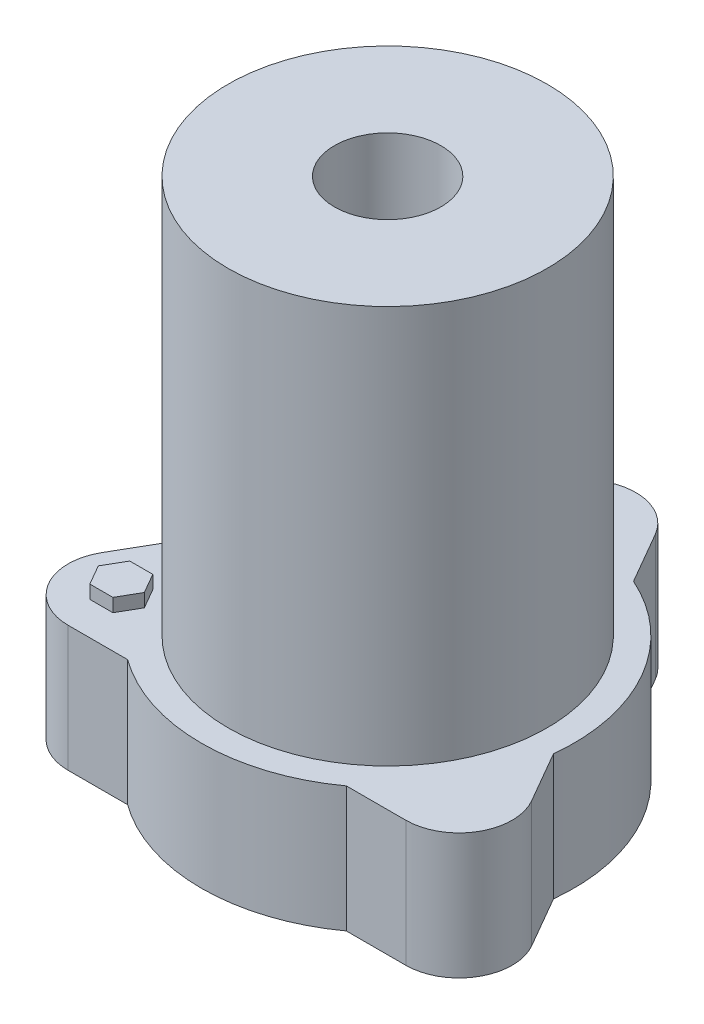
ISO-10303-21;
HEADER;
FILE_DESCRIPTION(('STEP AP214'),'2;1');
FILE_NAME('part.step','',(''),(''),'','','');
FILE_SCHEMA(('AUTOMOTIVE_DESIGN { 1 0 10303 214 1 1 1 1 }'));
ENDSEC;
DATA;
#1=APPLICATION_CONTEXT('core data for automotive mechanical design processes');
#2=APPLICATION_PROTOCOL_DEFINITION('international standard','automotive_design',2000,#1);
#3=PRODUCT_CONTEXT('',#1,'mechanical');
#4=PRODUCT('Part','Part','',(#3));
#5=PRODUCT_RELATED_PRODUCT_CATEGORY('part','',(#4));
#6=PRODUCT_DEFINITION_FORMATION('','',#4);
#7=PRODUCT_DEFINITION_CONTEXT('part definition',#1,'design');
#8=PRODUCT_DEFINITION('design','',#6,#7);
#9=PRODUCT_DEFINITION_SHAPE('','',#8);
#10=(LENGTH_UNIT() NAMED_UNIT(*) SI_UNIT(.MILLI.,.METRE.));
#11=(NAMED_UNIT(*) PLANE_ANGLE_UNIT() SI_UNIT($,.RADIAN.));
#12=(NAMED_UNIT(*) SI_UNIT($,.STERADIAN.) SOLID_ANGLE_UNIT());
#13=UNCERTAINTY_MEASURE_WITH_UNIT(LENGTH_MEASURE(1.E-05),#10,'distance_accuracy_value','');
#14=(GEOMETRIC_REPRESENTATION_CONTEXT(3) GLOBAL_UNCERTAINTY_ASSIGNED_CONTEXT((#13)) GLOBAL_UNIT_ASSIGNED_CONTEXT((#10,
#11,#12)) REPRESENTATION_CONTEXT('',''));
#15=CARTESIAN_POINT('',(0.,0.,0.));
#16=DIRECTION('',(0.,0.,1.));
#17=DIRECTION('',(1.,0.,0.));
#18=AXIS2_PLACEMENT_3D('',#15,#16,#17);
#19=CARTESIAN_POINT('',(0.,60.,0.));
#20=DIRECTION('',(0.,1.,0.));
#21=DIRECTION('',(0.,0.,1.));
#22=AXIS2_PLACEMENT_3D('',#19,#20,#21);
#23=PLANE('',#22);
#24=CARTESIAN_POINT('',(0.,60.,0.));
#25=DIRECTION('',(0.,1.,0.));
#26=DIRECTION('',(0.,0.,1.));
#27=AXIS2_PLACEMENT_3D('',#24,#25,#26);
#28=CIRCLE('',#27,76.2);
#29=CARTESIAN_POINT('',(0.,60.,76.2));
#30=VERTEX_POINT('',#29);
#31=EDGE_CURVE('E260',#30,#30,#28,.T.);
#32=ORIENTED_EDGE('',*,*,#31,.F.);
#33=EDGE_LOOP('',(#32));
#34=FACE_BOUND('',#33,.T.);
#35=CARTESIAN_POINT('',(0.,60.,-93.094792167701));
#36=DIRECTION('',(0.,1.,0.));
#37=DIRECTION('',(0.,0.,1.));
#38=AXIS2_PLACEMENT_3D('',#35,#36,#37);
#39=CIRCLE('',#38,25.4000000000001);
#40=CARTESIAN_POINT('',(-21.9970452561249,60.,-105.794792167701));
#41=VERTEX_POINT('',#40);
#42=CARTESIAN_POINT('',(21.997045256125,60.,-105.794792167701));
#43=VERTEX_POINT('',#42);
#44=EDGE_CURVE('E290',#41,#43,#39,.F.);
#45=ORIENTED_EDGE('',*,*,#44,.F.);
#46=DIRECTION('',(-0.5,0.,0.866025403784439));
#47=VECTOR('',#46,1.);
#48=CARTESIAN_POINT('',(-62.3082727447555,60.,-35.9736980419252));
#49=LINE('',#48,#47);
#50=CARTESIAN_POINT('',(-36.1989726930806,60.,-81.1963322814868));
#51=VERTEX_POINT('',#50);
#52=EDGE_CURVE('E287',#41,#51,#49,.T.);
#53=ORIENTED_EDGE('',*,*,#52,.T.);
#54=CARTESIAN_POINT('',(0.,60.,0.));
#55=DIRECTION('',(0.,1.,0.));
#56=DIRECTION('',(0.,0.,1.));
#57=AXIS2_PLACEMENT_3D('',#54,#55,#56);
#58=CIRCLE('',#57,88.9);
#59=CARTESIAN_POINT('',(-88.4175727964302,60.,9.24893619763675));
#60=VERTEX_POINT('',#59);
#61=EDGE_CURVE('E211',#51,#60,#58,.T.);
#62=ORIENTED_EDGE('',*,*,#61,.T.);
#63=DIRECTION('',(-0.499999999999999,0.,0.866025403784439));
#64=VECTOR('',#63,1.);
#65=CARTESIAN_POINT('',(-62.3082727447553,60.,-35.973698041925));
#66=LINE('',#65,#64);
#67=CARTESIAN_POINT('',(-102.619500233386,60.,33.8473960838506));
#68=VERTEX_POINT('',#67);
#69=EDGE_CURVE('E281',#60,#68,#66,.T.);
#70=ORIENTED_EDGE('',*,*,#69,.T.);
#71=CARTESIAN_POINT('',(-80.6224549772613,60.,46.5473960838508));
#72=DIRECTION('',(0.,1.,0.));
#73=DIRECTION('',(0.,0.,1.));
#74=AXIS2_PLACEMENT_3D('',#71,#72,#73);
#75=CIRCLE('',#74,25.4);
#76=CARTESIAN_POINT('',(-80.6224549772608,60.,71.9473960838508));
#77=VERTEX_POINT('',#76);
#78=EDGE_CURVE('E277',#68,#77,#75,.T.);
#79=ORIENTED_EDGE('',*,*,#78,.T.);
#80=DIRECTION('',(1.,0.,0.));
#81=VECTOR('',#80,1.);
#82=CARTESIAN_POINT('',(0.,60.,71.9473960838508));
#83=LINE('',#82,#81);
#84=CARTESIAN_POINT('',(-52.2186001033495,60.,71.9473960838508));
#85=VERTEX_POINT('',#84);
#86=EDGE_CURVE('E273',#77,#85,#83,.T.);
#87=ORIENTED_EDGE('',*,*,#86,.T.);
#88=CARTESIAN_POINT('',(0.,60.,0.));
#89=DIRECTION('',(0.,1.,0.));
#90=DIRECTION('',(0.,0.,1.));
#91=AXIS2_PLACEMENT_3D('',#88,#89,#90);
#92=CIRCLE('',#91,88.9000000000001);
#93=CARTESIAN_POINT('',(52.2186001033503,60.,71.9473960838499));
#94=VERTEX_POINT('',#93);
#95=EDGE_CURVE('E269',#85,#94,#92,.T.);
#96=ORIENTED_EDGE('',*,*,#95,.T.);
#97=DIRECTION('',(1.,0.,0.));
#98=VECTOR('',#97,1.);
#99=CARTESIAN_POINT('',(0.,60.,71.9473960838499));
#100=LINE('',#99,#98);
#101=CARTESIAN_POINT('',(80.6224549772621,60.,71.9473960838499));
#102=VERTEX_POINT('',#101);
#103=EDGE_CURVE('E266',#94,#102,#100,.T.);
#104=ORIENTED_EDGE('',*,*,#103,.T.);
#105=CARTESIAN_POINT('',(80.6224549772621,60.,46.5473960838497));
#106=DIRECTION('',(0.,1.,0.));
#107=DIRECTION('',(0.,0.,1.));
#108=AXIS2_PLACEMENT_3D('',#105,#106,#107);
#109=CIRCLE('',#108,25.4000000000001);
#110=CARTESIAN_POINT('',(102.619500233387,60.,33.8473960838493));
#111=VERTEX_POINT('',#110);
#112=EDGE_CURVE('E161',#102,#111,#109,.T.);
#113=ORIENTED_EDGE('',*,*,#112,.T.);
#114=DIRECTION('',(-0.5,0.,-0.866025403784439));
#115=VECTOR('',#114,1.);
#116=CARTESIAN_POINT('',(62.3082727447563,60.,-35.9736980419257));
#117=LINE('',#116,#115);
#118=CARTESIAN_POINT('',(88.4175727964306,60.,9.24893619763493));
#119=VERTEX_POINT('',#118);
#120=EDGE_CURVE('E156',#111,#119,#117,.T.);
#121=ORIENTED_EDGE('',*,*,#120,.T.);
#122=CARTESIAN_POINT('',(0.,60.,0.));
#123=DIRECTION('',(0.,1.,0.));
#124=DIRECTION('',(0.,0.,1.));
#125=AXIS2_PLACEMENT_3D('',#122,#123,#124);
#126=CIRCLE('',#125,88.9);
#127=CARTESIAN_POINT('',(36.1989726930812,60.,-81.1963322814865));
#128=VERTEX_POINT('',#127);
#129=EDGE_CURVE('E146',#119,#128,#126,.T.);
#130=ORIENTED_EDGE('',*,*,#129,.T.);
#131=DIRECTION('',(-0.5,0.,-0.866025403784439));
#132=VECTOR('',#131,1.);
#133=CARTESIAN_POINT('',(62.3082727447557,60.,-35.9736980419253));
#134=LINE('',#133,#132);
#135=EDGE_CURVE('E66',#128,#43,#134,.T.);
#136=ORIENTED_EDGE('',*,*,#135,.T.);
#137=EDGE_LOOP('',(#45,#53,#62,#70,#79,#87,#96,#104,#113,#121,#130,#136));
#138=FACE_BOUND('',#137,.T.);
#139=DIRECTION('',(-0.5,0.,-0.866025403784439));
#140=VECTOR('',#139,1.);
#141=CARTESIAN_POINT('',(-69.623932349199,60.,46.5473960838508));
#142=LINE('',#141,#140);
#143=CARTESIAN_POINT('',(-69.623932349199,60.,46.5473960838508));
#144=VERTEX_POINT('',#143);
#145=CARTESIAN_POINT('',(-75.1231936632301,60.,37.0223960838508));
#146=VERTEX_POINT('',#145);
#147=EDGE_CURVE('E333',#144,#146,#142,.T.);
#148=ORIENTED_EDGE('',*,*,#147,.F.);
#149=DIRECTION('',(0.5,0.,-0.866025403784439));
#150=VECTOR('',#149,1.);
#151=CARTESIAN_POINT('',(-75.1231936632301,60.,56.0723960838508));
#152=LINE('',#151,#150);
#153=CARTESIAN_POINT('',(-75.1231936632301,60.,56.0723960838508));
#154=VERTEX_POINT('',#153);
#155=EDGE_CURVE('E337',#154,#144,#152,.T.);
#156=ORIENTED_EDGE('',*,*,#155,.F.);
#157=DIRECTION('',(1.,0.,0.));
#158=VECTOR('',#157,1.);
#159=CARTESIAN_POINT('',(-86.1217162912925,60.,56.0723960838508));
#160=LINE('',#159,#158);
#161=CARTESIAN_POINT('',(-86.1217162912925,60.,56.0723960838508));
#162=VERTEX_POINT('',#161);
#163=EDGE_CURVE('E318',#162,#154,#160,.T.);
#164=ORIENTED_EDGE('',*,*,#163,.F.);
#165=DIRECTION('',(0.499999999999999,0.,0.866025403784439));
#166=VECTOR('',#165,1.);
#167=CARTESIAN_POINT('',(-91.6209776053237,60.,46.5473960838508));
#168=LINE('',#167,#166);
#169=CARTESIAN_POINT('',(-91.6209776053237,60.,46.5473960838508));
#170=VERTEX_POINT('',#169);
#171=EDGE_CURVE('E322',#170,#162,#168,.T.);
#172=ORIENTED_EDGE('',*,*,#171,.F.);
#173=DIRECTION('',(-0.499999999999999,0.,0.866025403784439));
#174=VECTOR('',#173,1.);
#175=CARTESIAN_POINT('',(-86.1217162912925,60.,37.0223960838508));
#176=LINE('',#175,#174);
#177=CARTESIAN_POINT('',(-86.1217162912925,60.,37.0223960838508));
#178=VERTEX_POINT('',#177);
#179=EDGE_CURVE('E325',#178,#170,#176,.T.);
#180=ORIENTED_EDGE('',*,*,#179,.F.);
#181=DIRECTION('',(-1.,0.,0.));
#182=VECTOR('',#181,1.);
#183=CARTESIAN_POINT('',(-75.1231936632301,60.,37.0223960838508));
#184=LINE('',#183,#182);
#185=EDGE_CURVE('E329',#146,#178,#184,.T.);
#186=ORIENTED_EDGE('',*,*,#185,.F.);
#187=EDGE_LOOP('',(#148,#156,#164,#172,#180,#186));
#188=FACE_BOUND('',#187,.T.);
#189=ADVANCED_FACE('F41',(#34,#138,#188),#23,.T.);
#190=CARTESIAN_POINT('',(0.,60.,-93.094792167701));
#191=DIRECTION('',(0.,-1.,0.));
#192=DIRECTION('',(0.,0.,-1.));
#193=AXIS2_PLACEMENT_3D('',#190,#191,#192);
#194=CYLINDRICAL_SURFACE('',#193,25.4000000000001);
#195=CARTESIAN_POINT('',(0.,0.,-93.094792167701));
#196=DIRECTION('',(0.,1.,0.));
#197=DIRECTION('',(0.,0.,1.));
#198=AXIS2_PLACEMENT_3D('',#195,#196,#197);
#199=CIRCLE('',#198,25.4000000000001);
#200=CARTESIAN_POINT('',(-21.9970452561249,0.,-105.794792167701));
#201=VERTEX_POINT('',#200);
#202=CARTESIAN_POINT('',(21.997045256125,0.,-105.794792167701));
#203=VERTEX_POINT('',#202);
#204=EDGE_CURVE('E220',#201,#203,#199,.F.);
#205=ORIENTED_EDGE('',*,*,#204,.F.);
#206=DIRECTION('',(0.,-1.,0.));
#207=VECTOR('',#206,1.);
#208=CARTESIAN_POINT('',(-21.9970452561249,60.,-105.794792167701));
#209=LINE('',#208,#207);
#210=EDGE_CURVE('E11',#41,#201,#209,.T.);
#211=ORIENTED_EDGE('',*,*,#210,.F.);
#212=ORIENTED_EDGE('',*,*,#44,.T.);
#213=DIRECTION('',(0.,-1.,0.));
#214=VECTOR('',#213,1.);
#215=CARTESIAN_POINT('',(21.997045256125,60.,-105.794792167701));
#216=LINE('',#215,#214);
#217=EDGE_CURVE('E110',#43,#203,#216,.T.);
#218=ORIENTED_EDGE('',*,*,#217,.T.);
#219=EDGE_LOOP('',(#205,#211,#212,#218));
#220=FACE_BOUND('',#219,.T.);
#221=ADVANCED_FACE('F43',(#220),#194,.T.);
#222=CARTESIAN_POINT('',(-62.3082727447555,60.,-35.9736980419252));
#223=DIRECTION('',(0.866025403784439,0.,0.5));
#224=DIRECTION('',(0.5,0.,-0.866025403784439));
#225=AXIS2_PLACEMENT_3D('',#222,#223,#224);
#226=PLANE('',#225);
#227=DIRECTION('',(-0.5,0.,0.866025403784439));
#228=VECTOR('',#227,1.);
#229=CARTESIAN_POINT('',(-62.3082727447555,0.,-35.9736980419252));
#230=LINE('',#229,#228);
#231=CARTESIAN_POINT('',(-36.1989726930806,0.,-81.1963322814868));
#232=VERTEX_POINT('',#231);
#233=EDGE_CURVE('E215',#201,#232,#230,.T.);
#234=ORIENTED_EDGE('',*,*,#233,.T.);
#235=DIRECTION('',(0.,-1.,0.));
#236=VECTOR('',#235,1.);
#237=CARTESIAN_POINT('',(-36.1989726930806,60.,-81.1963322814868));
#238=LINE('',#237,#236);
#239=EDGE_CURVE('E50',#51,#232,#238,.T.);
#240=ORIENTED_EDGE('',*,*,#239,.F.);
#241=ORIENTED_EDGE('',*,*,#52,.F.);
#242=ORIENTED_EDGE('',*,*,#210,.T.);
#243=EDGE_LOOP('',(#234,#240,#241,#242));
#244=FACE_BOUND('',#243,.T.);
#245=ADVANCED_FACE('F216',(#244),#226,.F.);
#246=CARTESIAN_POINT('',(0.,60.,0.));
#247=DIRECTION('',(0.,-1.,0.));
#248=DIRECTION('',(0.,0.,-1.));
#249=AXIS2_PLACEMENT_3D('',#246,#247,#248);
#250=CYLINDRICAL_SURFACE('',#249,88.9);
#251=CARTESIAN_POINT('',(0.,0.,0.));
#252=DIRECTION('',(0.,1.,0.));
#253=DIRECTION('',(0.,0.,1.));
#254=AXIS2_PLACEMENT_3D('',#251,#252,#253);
#255=CIRCLE('',#254,88.9);
#256=CARTESIAN_POINT('',(-88.4175727964302,0.,9.24893619763675));
#257=VERTEX_POINT('',#256);
#258=EDGE_CURVE('E209',#232,#257,#255,.T.);
#259=ORIENTED_EDGE('',*,*,#258,.T.);
#260=DIRECTION('',(0.,-1.,0.));
#261=VECTOR('',#260,1.);
#262=CARTESIAN_POINT('',(-88.4175727964302,60.,9.24893619763675));
#263=LINE('',#262,#261);
#264=EDGE_CURVE('E198',#60,#257,#263,.T.);
#265=ORIENTED_EDGE('',*,*,#264,.F.);
#266=ORIENTED_EDGE('',*,*,#61,.F.);
#267=ORIENTED_EDGE('',*,*,#239,.T.);
#268=EDGE_LOOP('',(#259,#265,#266,#267));
#269=FACE_BOUND('',#268,.T.);
#270=ADVANCED_FACE('F207',(#269),#250,.T.);
#271=CARTESIAN_POINT('',(-62.3082727447553,60.,-35.973698041925));
#272=DIRECTION('',(0.866025403784439,0.,0.499999999999999));
#273=DIRECTION('',(0.499999999999999,0.,-0.866025403784439));
#274=AXIS2_PLACEMENT_3D('',#271,#272,#273);
#275=PLANE('',#274);
#276=DIRECTION('',(-0.499999999999999,0.,0.866025403784439));
#277=VECTOR('',#276,1.);
#278=CARTESIAN_POINT('',(-62.3082727447553,0.,-35.973698041925));
#279=LINE('',#278,#277);
#280=CARTESIAN_POINT('',(-102.619500233386,0.,33.8473960838506));
#281=VERTEX_POINT('',#280);
#282=EDGE_CURVE('E224',#257,#281,#279,.T.);
#283=ORIENTED_EDGE('',*,*,#282,.T.);
#284=DIRECTION('',(0.,-1.,0.));
#285=VECTOR('',#284,1.);
#286=CARTESIAN_POINT('',(-102.619500233386,60.,33.8473960838506));
#287=LINE('',#286,#285);
#288=EDGE_CURVE('E194',#68,#281,#287,.T.);
#289=ORIENTED_EDGE('',*,*,#288,.F.);
#290=ORIENTED_EDGE('',*,*,#69,.F.);
#291=ORIENTED_EDGE('',*,*,#264,.T.);
#292=EDGE_LOOP('',(#283,#289,#290,#291));
#293=FACE_BOUND('',#292,.T.);
#294=ADVANCED_FACE('F442',(#293),#275,.F.);
#295=CARTESIAN_POINT('',(-80.6224549772613,60.,46.5473960838508));
#296=DIRECTION('',(0.,-1.,0.));
#297=DIRECTION('',(0.,0.,-1.));
#298=AXIS2_PLACEMENT_3D('',#295,#296,#297);
#299=CYLINDRICAL_SURFACE('',#298,25.4);
#300=CARTESIAN_POINT('',(-80.6224549772613,0.,46.5473960838508));
#301=DIRECTION('',(0.,1.,0.));
#302=DIRECTION('',(0.,0.,1.));
#303=AXIS2_PLACEMENT_3D('',#300,#301,#302);
#304=CIRCLE('',#303,25.4);
#305=CARTESIAN_POINT('',(-80.6224549772608,0.,71.9473960838508));
#306=VERTEX_POINT('',#305);
#307=EDGE_CURVE('E233',#281,#306,#304,.T.);
#308=ORIENTED_EDGE('',*,*,#307,.T.);
#309=DIRECTION('',(0.,-1.,0.));
#310=VECTOR('',#309,1.);
#311=CARTESIAN_POINT('',(-80.6224549772608,60.,71.9473960838508));
#312=LINE('',#311,#310);
#313=EDGE_CURVE('E190',#77,#306,#312,.T.);
#314=ORIENTED_EDGE('',*,*,#313,.F.);
#315=ORIENTED_EDGE('',*,*,#78,.F.);
#316=ORIENTED_EDGE('',*,*,#288,.T.);
#317=EDGE_LOOP('',(#308,#314,#315,#316));
#318=FACE_BOUND('',#317,.T.);
#319=ADVANCED_FACE('F438',(#318),#299,.T.);
#320=CARTESIAN_POINT('',(0.,60.,71.9473960838508));
#321=DIRECTION('',(0.,0.,-1.));
#322=DIRECTION('',(-1.,0.,0.));
#323=AXIS2_PLACEMENT_3D('',#320,#321,#322);
#324=PLANE('',#323);
#325=DIRECTION('',(1.,0.,0.));
#326=VECTOR('',#325,1.);
#327=CARTESIAN_POINT('',(0.,0.,71.9473960838508));
#328=LINE('',#327,#326);
#329=CARTESIAN_POINT('',(-52.2186001033495,0.,71.9473960838508));
#330=VERTEX_POINT('',#329);
#331=EDGE_CURVE('E237',#306,#330,#328,.T.);
#332=ORIENTED_EDGE('',*,*,#331,.T.);
#333=DIRECTION('',(0.,-1.,0.));
#334=VECTOR('',#333,1.);
#335=CARTESIAN_POINT('',(-52.2186001033495,60.,71.9473960838508));
#336=LINE('',#335,#334);
#337=EDGE_CURVE('E186',#85,#330,#336,.T.);
#338=ORIENTED_EDGE('',*,*,#337,.F.);
#339=ORIENTED_EDGE('',*,*,#86,.F.);
#340=ORIENTED_EDGE('',*,*,#313,.T.);
#341=EDGE_LOOP('',(#332,#338,#339,#340));
#342=FACE_BOUND('',#341,.T.);
#343=ADVANCED_FACE('F434',(#342),#324,.F.);
#344=CARTESIAN_POINT('',(0.,60.,0.));
#345=DIRECTION('',(0.,-1.,0.));
#346=DIRECTION('',(0.,0.,-1.));
#347=AXIS2_PLACEMENT_3D('',#344,#345,#346);
#348=CYLINDRICAL_SURFACE('',#347,88.9000000000001);
#349=CARTESIAN_POINT('',(0.,0.,0.));
#350=DIRECTION('',(0.,1.,0.));
#351=DIRECTION('',(0.,0.,1.));
#352=AXIS2_PLACEMENT_3D('',#349,#350,#351);
#353=CIRCLE('',#352,88.9000000000001);
#354=CARTESIAN_POINT('',(52.2186001033503,0.,71.9473960838499));
#355=VERTEX_POINT('',#354);
#356=EDGE_CURVE('E241',#330,#355,#353,.T.);
#357=ORIENTED_EDGE('',*,*,#356,.T.);
#358=DIRECTION('',(0.,-1.,0.));
#359=VECTOR('',#358,1.);
#360=CARTESIAN_POINT('',(52.2186001033503,60.,71.9473960838499));
#361=LINE('',#360,#359);
#362=EDGE_CURVE('E182',#94,#355,#361,.T.);
#363=ORIENTED_EDGE('',*,*,#362,.F.);
#364=ORIENTED_EDGE('',*,*,#95,.F.);
#365=ORIENTED_EDGE('',*,*,#337,.T.);
#366=EDGE_LOOP('',(#357,#363,#364,#365));
#367=FACE_BOUND('',#366,.T.);
#368=ADVANCED_FACE('F430',(#367),#348,.T.);
#369=CARTESIAN_POINT('',(0.,60.,71.9473960838499));
#370=DIRECTION('',(0.,0.,-1.));
#371=DIRECTION('',(-1.,0.,0.));
#372=AXIS2_PLACEMENT_3D('',#369,#370,#371);
#373=PLANE('',#372);
#374=DIRECTION('',(1.,0.,0.));
#375=VECTOR('',#374,1.);
#376=CARTESIAN_POINT('',(0.,0.,71.9473960838499));
#377=LINE('',#376,#375);
#378=CARTESIAN_POINT('',(80.6224549772621,0.,71.9473960838499));
#379=VERTEX_POINT('',#378);
#380=EDGE_CURVE('E245',#355,#379,#377,.T.);
#381=ORIENTED_EDGE('',*,*,#380,.T.);
#382=DIRECTION('',(0.,-1.,0.));
#383=VECTOR('',#382,1.);
#384=CARTESIAN_POINT('',(80.6224549772621,60.,71.9473960838499));
#385=LINE('',#384,#383);
#386=EDGE_CURVE('E174',#102,#379,#385,.T.);
#387=ORIENTED_EDGE('',*,*,#386,.F.);
#388=ORIENTED_EDGE('',*,*,#103,.F.);
#389=ORIENTED_EDGE('',*,*,#362,.T.);
#390=EDGE_LOOP('',(#381,#387,#388,#389));
#391=FACE_BOUND('',#390,.T.);
#392=ADVANCED_FACE('F426',(#391),#373,.F.);
#393=CARTESIAN_POINT('',(80.6224549772621,60.,46.5473960838497));
#394=DIRECTION('',(0.,-1.,0.));
#395=DIRECTION('',(0.,0.,-1.));
#396=AXIS2_PLACEMENT_3D('',#393,#394,#395);
#397=CYLINDRICAL_SURFACE('',#396,25.4000000000001);
#398=CARTESIAN_POINT('',(80.6224549772621,0.,46.5473960838497));
#399=DIRECTION('',(0.,1.,0.));
#400=DIRECTION('',(0.,0.,1.));
#401=AXIS2_PLACEMENT_3D('',#398,#399,#400);
#402=CIRCLE('',#401,25.4000000000001);
#403=CARTESIAN_POINT('',(102.619500233387,0.,33.8473960838493));
#404=VERTEX_POINT('',#403);
#405=EDGE_CURVE('E249',#379,#404,#402,.T.);
#406=ORIENTED_EDGE('',*,*,#405,.T.);
#407=DIRECTION('',(0.,-1.,0.));
#408=VECTOR('',#407,1.);
#409=CARTESIAN_POINT('',(102.619500233387,60.,33.8473960838493));
#410=LINE('',#409,#408);
#411=EDGE_CURVE('E170',#111,#404,#410,.T.);
#412=ORIENTED_EDGE('',*,*,#411,.F.);
#413=ORIENTED_EDGE('',*,*,#112,.F.);
#414=ORIENTED_EDGE('',*,*,#386,.T.);
#415=EDGE_LOOP('',(#406,#412,#413,#414));
#416=FACE_BOUND('',#415,.T.);
#417=ADVANCED_FACE('F423',(#416),#397,.T.);
#418=CARTESIAN_POINT('',(62.3082727447563,60.,-35.9736980419257));
#419=DIRECTION('',(-0.866025403784439,0.,0.5));
#420=DIRECTION('',(0.5,0.,0.866025403784439));
#421=AXIS2_PLACEMENT_3D('',#418,#419,#420);
#422=PLANE('',#421);
#423=DIRECTION('',(-0.5,0.,-0.866025403784439));
#424=VECTOR('',#423,1.);
#425=CARTESIAN_POINT('',(62.3082727447563,0.,-35.9736980419257));
#426=LINE('',#425,#424);
#427=CARTESIAN_POINT('',(88.4175727964306,0.,9.24893619763493));
#428=VERTEX_POINT('',#427);
#429=EDGE_CURVE('E168',#404,#428,#426,.T.);
#430=ORIENTED_EDGE('',*,*,#429,.T.);
#431=DIRECTION('',(0.,-1.,0.));
#432=VECTOR('',#431,1.);
#433=CARTESIAN_POINT('',(88.4175727964306,60.,9.24893619763493));
#434=LINE('',#433,#432);
#435=EDGE_CURVE('E151',#119,#428,#434,.T.);
#436=ORIENTED_EDGE('',*,*,#435,.F.);
#437=ORIENTED_EDGE('',*,*,#120,.F.);
#438=ORIENTED_EDGE('',*,*,#411,.T.);
#439=EDGE_LOOP('',(#430,#436,#437,#438));
#440=FACE_BOUND('',#439,.T.);
#441=ADVANCED_FACE('F167',(#440),#422,.F.);
#442=CARTESIAN_POINT('',(0.,60.,0.));
#443=DIRECTION('',(0.,-1.,0.));
#444=DIRECTION('',(0.,0.,-1.));
#445=AXIS2_PLACEMENT_3D('',#442,#443,#444);
#446=CYLINDRICAL_SURFACE('',#445,88.9);
#447=CARTESIAN_POINT('',(0.,0.,0.));
#448=DIRECTION('',(0.,1.,0.));
#449=DIRECTION('',(0.,0.,1.));
#450=AXIS2_PLACEMENT_3D('',#447,#448,#449);
#451=CIRCLE('',#450,88.9);
#452=CARTESIAN_POINT('',(36.1989726930812,0.,-81.1963322814865));
#453=VERTEX_POINT('',#452);
#454=EDGE_CURVE('E255',#428,#453,#451,.T.);
#455=ORIENTED_EDGE('',*,*,#454,.T.);
#456=DIRECTION('',(0.,-1.,0.));
#457=VECTOR('',#456,1.);
#458=CARTESIAN_POINT('',(36.1989726930812,60.,-81.1963322814865));
#459=LINE('',#458,#457);
#460=EDGE_CURVE('E154',#128,#453,#459,.T.);
#461=ORIENTED_EDGE('',*,*,#460,.F.);
#462=ORIENTED_EDGE('',*,*,#129,.F.);
#463=ORIENTED_EDGE('',*,*,#435,.T.);
#464=EDGE_LOOP('',(#455,#461,#462,#463));
#465=FACE_BOUND('',#464,.T.);
#466=ADVANCED_FACE('F149',(#465),#446,.T.);
#467=CARTESIAN_POINT('',(62.3082727447557,60.,-35.9736980419253));
#468=DIRECTION('',(-0.866025403784439,0.,0.5));
#469=DIRECTION('',(0.5,0.,0.866025403784439));
#470=AXIS2_PLACEMENT_3D('',#467,#468,#469);
#471=PLANE('',#470);
#472=DIRECTION('',(-0.5,0.,-0.866025403784439));
#473=VECTOR('',#472,1.);
#474=CARTESIAN_POINT('',(62.3082727447557,0.,-35.9736980419253));
#475=LINE('',#474,#473);
#476=EDGE_CURVE('E258',#453,#203,#475,.T.);
#477=ORIENTED_EDGE('',*,*,#476,.T.);
#478=ORIENTED_EDGE('',*,*,#217,.F.);
#479=ORIENTED_EDGE('',*,*,#135,.F.);
#480=ORIENTED_EDGE('',*,*,#460,.T.);
#481=EDGE_LOOP('',(#477,#478,#479,#480));
#482=FACE_BOUND('',#481,.T.);
#483=ADVANCED_FACE('F415',(#482),#471,.F.);
#484=CARTESIAN_POINT('',(0.,0.,0.));
#485=DIRECTION('',(0.,1.,0.));
#486=DIRECTION('',(0.,0.,1.));
#487=AXIS2_PLACEMENT_3D('',#484,#485,#486);
#488=PLANE('',#487);
#489=ORIENTED_EDGE('',*,*,#204,.T.);
#490=ORIENTED_EDGE('',*,*,#476,.F.);
#491=ORIENTED_EDGE('',*,*,#454,.F.);
#492=ORIENTED_EDGE('',*,*,#429,.F.);
#493=ORIENTED_EDGE('',*,*,#405,.F.);
#494=ORIENTED_EDGE('',*,*,#380,.F.);
#495=ORIENTED_EDGE('',*,*,#356,.F.);
#496=ORIENTED_EDGE('',*,*,#331,.F.);
#497=ORIENTED_EDGE('',*,*,#307,.F.);
#498=ORIENTED_EDGE('',*,*,#282,.F.);
#499=ORIENTED_EDGE('',*,*,#258,.F.);
#500=ORIENTED_EDGE('',*,*,#233,.F.);
#501=EDGE_LOOP('',(#489,#490,#491,#492,#493,#494,#495,#496,#497,#498,#499,#500));
#502=FACE_BOUND('',#501,.T.);
#503=ADVANCED_FACE('F412',(#502),#488,.F.);
#504=CARTESIAN_POINT('',(-75.1231936632301,66.35,56.0723960838508));
#505=DIRECTION('',(-0.866025403784439,0.,-0.5));
#506=DIRECTION('',(-0.5,0.,0.866025403784439));
#507=AXIS2_PLACEMENT_3D('',#504,#505,#506);
#508=PLANE('',#507);
#509=ORIENTED_EDGE('',*,*,#155,.T.);
#510=DIRECTION('',(0.,-1.,0.));
#511=VECTOR('',#510,1.);
#512=CARTESIAN_POINT('',(-69.623932349199,66.35,46.5473960838508));
#513=LINE('',#512,#511);
#514=CARTESIAN_POINT('',(-69.623932349199,66.35,46.5473960838508));
#515=VERTEX_POINT('',#514);
#516=EDGE_CURVE('E226',#515,#144,#513,.T.);
#517=ORIENTED_EDGE('',*,*,#516,.F.);
#518=DIRECTION('',(0.5,0.,-0.866025403784439));
#519=VECTOR('',#518,1.);
#520=CARTESIAN_POINT('',(-75.1231936632301,66.35,56.0723960838508));
#521=LINE('',#520,#519);
#522=CARTESIAN_POINT('',(-75.1231936632301,66.35,56.0723960838508));
#523=VERTEX_POINT('',#522);
#524=EDGE_CURVE('E321',#523,#515,#521,.T.);
#525=ORIENTED_EDGE('',*,*,#524,.F.);
#526=DIRECTION('',(0.,-1.,0.));
#527=VECTOR('',#526,1.);
#528=CARTESIAN_POINT('',(-75.1231936632301,66.35,56.0723960838508));
#529=LINE('',#528,#527);
#530=EDGE_CURVE('E313',#523,#154,#529,.T.);
#531=ORIENTED_EDGE('',*,*,#530,.T.);
#532=EDGE_LOOP('',(#509,#517,#525,#531));
#533=FACE_BOUND('',#532,.T.);
#534=ADVANCED_FACE('F410',(#533),#508,.F.);
#535=CARTESIAN_POINT('',(-69.623932349199,66.35,46.5473960838508));
#536=DIRECTION('',(-0.866025403784439,0.,0.5));
#537=DIRECTION('',(0.5,0.,0.866025403784439));
#538=AXIS2_PLACEMENT_3D('',#535,#536,#537);
#539=PLANE('',#538);
#540=ORIENTED_EDGE('',*,*,#147,.T.);
#541=DIRECTION('',(0.,-1.,0.));
#542=VECTOR('',#541,1.);
#543=CARTESIAN_POINT('',(-75.1231936632301,66.35,37.0223960838508));
#544=LINE('',#543,#542);
#545=CARTESIAN_POINT('',(-75.1231936632301,66.35,37.0223960838508));
#546=VERTEX_POINT('',#545);
#547=EDGE_CURVE('E299',#546,#146,#544,.T.);
#548=ORIENTED_EDGE('',*,*,#547,.F.);
#549=DIRECTION('',(-0.5,0.,-0.866025403784439));
#550=VECTOR('',#549,1.);
#551=CARTESIAN_POINT('',(-69.623932349199,66.35,46.5473960838508));
#552=LINE('',#551,#550);
#553=EDGE_CURVE('E357',#515,#546,#552,.T.);
#554=ORIENTED_EDGE('',*,*,#553,.F.);
#555=ORIENTED_EDGE('',*,*,#516,.T.);
#556=EDGE_LOOP('',(#540,#548,#554,#555));
#557=FACE_BOUND('',#556,.T.);
#558=ADVANCED_FACE('F504',(#557),#539,.F.);
#559=CARTESIAN_POINT('',(-75.1231936632301,66.35,37.0223960838508));
#560=DIRECTION('',(0.,0.,1.));
#561=DIRECTION('',(1.,0.,0.));
#562=AXIS2_PLACEMENT_3D('',#559,#560,#561);
#563=PLANE('',#562);
#564=ORIENTED_EDGE('',*,*,#185,.T.);
#565=DIRECTION('',(0.,-1.,0.));
#566=VECTOR('',#565,1.);
#567=CARTESIAN_POINT('',(-86.1217162912925,66.35,37.0223960838508));
#568=LINE('',#567,#566);
#569=CARTESIAN_POINT('',(-86.1217162912925,66.35,37.0223960838508));
#570=VERTEX_POINT('',#569);
#571=EDGE_CURVE('E303',#570,#178,#568,.T.);
#572=ORIENTED_EDGE('',*,*,#571,.F.);
#573=DIRECTION('',(-1.,0.,0.));
#574=VECTOR('',#573,1.);
#575=CARTESIAN_POINT('',(-75.1231936632301,66.35,37.0223960838508));
#576=LINE('',#575,#574);
#577=EDGE_CURVE('E353',#546,#570,#576,.T.);
#578=ORIENTED_EDGE('',*,*,#577,.F.);
#579=ORIENTED_EDGE('',*,*,#547,.T.);
#580=EDGE_LOOP('',(#564,#572,#578,#579));
#581=FACE_BOUND('',#580,.T.);
#582=ADVANCED_FACE('F511',(#581),#563,.F.);
#583=CARTESIAN_POINT('',(-86.1217162912925,66.35,37.0223960838508));
#584=DIRECTION('',(0.866025403784439,0.,0.499999999999999));
#585=DIRECTION('',(0.499999999999999,0.,-0.866025403784439));
#586=AXIS2_PLACEMENT_3D('',#583,#584,#585);
#587=PLANE('',#586);
#588=ORIENTED_EDGE('',*,*,#179,.T.);
#589=DIRECTION('',(0.,-1.,0.));
#590=VECTOR('',#589,1.);
#591=CARTESIAN_POINT('',(-91.6209776053237,66.35,46.5473960838508));
#592=LINE('',#591,#590);
#593=CARTESIAN_POINT('',(-91.6209776053237,66.35,46.5473960838508));
#594=VERTEX_POINT('',#593);
#595=EDGE_CURVE('E307',#594,#170,#592,.T.);
#596=ORIENTED_EDGE('',*,*,#595,.F.);
#597=DIRECTION('',(-0.499999999999999,0.,0.866025403784439));
#598=VECTOR('',#597,1.);
#599=CARTESIAN_POINT('',(-86.1217162912925,66.35,37.0223960838508));
#600=LINE('',#599,#598);
#601=EDGE_CURVE('E349',#570,#594,#600,.T.);
#602=ORIENTED_EDGE('',*,*,#601,.F.);
#603=ORIENTED_EDGE('',*,*,#571,.T.);
#604=EDGE_LOOP('',(#588,#596,#602,#603));
#605=FACE_BOUND('',#604,.T.);
#606=ADVANCED_FACE('F518',(#605),#587,.F.);
#607=CARTESIAN_POINT('',(-91.6209776053237,66.35,46.5473960838508));
#608=DIRECTION('',(0.866025403784439,0.,-0.499999999999999));
#609=DIRECTION('',(-0.5,0.,-0.866025403784439));
#610=AXIS2_PLACEMENT_3D('',#607,#608,#609);
#611=PLANE('',#610);
#612=ORIENTED_EDGE('',*,*,#171,.T.);
#613=DIRECTION('',(0.,-1.,0.));
#614=VECTOR('',#613,1.);
#615=CARTESIAN_POINT('',(-86.1217162912925,66.35,56.0723960838508));
#616=LINE('',#615,#614);
#617=CARTESIAN_POINT('',(-86.1217162912925,66.35,56.0723960838508));
#618=VERTEX_POINT('',#617);
#619=EDGE_CURVE('E57',#618,#162,#616,.T.);
#620=ORIENTED_EDGE('',*,*,#619,.F.);
#621=DIRECTION('',(0.499999999999999,0.,0.866025403784439));
#622=VECTOR('',#621,1.);
#623=CARTESIAN_POINT('',(-91.6209776053237,66.35,46.5473960838508));
#624=LINE('',#623,#622);
#625=EDGE_CURVE('E345',#594,#618,#624,.T.);
#626=ORIENTED_EDGE('',*,*,#625,.F.);
#627=ORIENTED_EDGE('',*,*,#595,.T.);
#628=EDGE_LOOP('',(#612,#620,#626,#627));
#629=FACE_BOUND('',#628,.T.);
#630=ADVANCED_FACE('F526',(#629),#611,.F.);
#631=CARTESIAN_POINT('',(-86.1217162912925,66.35,56.0723960838508));
#632=DIRECTION('',(0.,0.,-1.));
#633=DIRECTION('',(-1.,0.,0.));
#634=AXIS2_PLACEMENT_3D('',#631,#632,#633);
#635=PLANE('',#634);
#636=ORIENTED_EDGE('',*,*,#163,.T.);
#637=ORIENTED_EDGE('',*,*,#530,.F.);
#638=DIRECTION('',(1.,0.,0.));
#639=VECTOR('',#638,1.);
#640=CARTESIAN_POINT('',(-86.1217162912925,66.35,56.0723960838508));
#641=LINE('',#640,#639);
#642=EDGE_CURVE('E317',#618,#523,#641,.T.);
#643=ORIENTED_EDGE('',*,*,#642,.F.);
#644=ORIENTED_EDGE('',*,*,#619,.T.);
#645=EDGE_LOOP('',(#636,#637,#643,#644));
#646=FACE_BOUND('',#645,.T.);
#647=ADVANCED_FACE('F398',(#646),#635,.F.);
#648=CARTESIAN_POINT('',(0.,66.35,0.));
#649=DIRECTION('',(0.,1.,0.));
#650=DIRECTION('',(0.,0.,1.));
#651=AXIS2_PLACEMENT_3D('',#648,#649,#650);
#652=PLANE('',#651);
#653=ORIENTED_EDGE('',*,*,#524,.T.);
#654=ORIENTED_EDGE('',*,*,#553,.T.);
#655=ORIENTED_EDGE('',*,*,#577,.T.);
#656=ORIENTED_EDGE('',*,*,#601,.T.);
#657=ORIENTED_EDGE('',*,*,#625,.T.);
#658=ORIENTED_EDGE('',*,*,#642,.T.);
#659=EDGE_LOOP('',(#653,#654,#655,#656,#657,#658));
#660=FACE_BOUND('',#659,.T.);
#661=ADVANCED_FACE('F392',(#660),#652,.T.);
#662=CARTESIAN_POINT('',(0.,250.,0.));
#663=DIRECTION('',(0.,-1.,0.));
#664=DIRECTION('',(0.,0.,-1.));
#665=AXIS2_PLACEMENT_3D('',#662,#663,#664);
#666=CYLINDRICAL_SURFACE('',#665,76.2);
#667=ORIENTED_EDGE('',*,*,#31,.T.);
#668=EDGE_LOOP('',(#667));
#669=FACE_BOUND('',#668,.T.);
#670=CARTESIAN_POINT('',(0.,250.,0.));
#671=DIRECTION('',(0.,-1.,0.));
#672=DIRECTION('',(0.,0.,-1.));
#673=AXIS2_PLACEMENT_3D('',#670,#671,#672);
#674=CIRCLE('',#673,76.2);
#675=CARTESIAN_POINT('',(0.,250.,-76.2));
#676=VERTEX_POINT('',#675);
#677=EDGE_CURVE('E341',#676,#676,#674,.T.);
#678=ORIENTED_EDGE('',*,*,#677,.T.);
#679=EDGE_LOOP('',(#678));
#680=FACE_BOUND('',#679,.T.);
#681=ADVANCED_FACE('F387',(#669,#680),#666,.T.);
#682=CARTESIAN_POINT('',(0.,250.,0.));
#683=DIRECTION('',(0.,-1.,0.));
#684=DIRECTION('',(0.,0.,-1.));
#685=AXIS2_PLACEMENT_3D('',#682,#683,#684);
#686=PLANE('',#685);
#687=CARTESIAN_POINT('',(0.,250.,0.));
#688=DIRECTION('',(0.,1.,0.));
#689=DIRECTION('',(0.,0.,1.));
#690=AXIS2_PLACEMENT_3D('',#687,#688,#689);
#691=CIRCLE('',#690,25.4);
#692=CARTESIAN_POINT('',(0.,250.,25.4));
#693=VERTEX_POINT('',#692);
#694=EDGE_CURVE('E368',#693,#693,#691,.T.);
#695=ORIENTED_EDGE('',*,*,#694,.F.);
#696=EDGE_LOOP('',(#695));
#697=FACE_BOUND('',#696,.T.);
#698=ORIENTED_EDGE('',*,*,#677,.F.);
#699=EDGE_LOOP('',(#698));
#700=FACE_BOUND('',#699,.T.);
#701=ADVANCED_FACE('F381',(#697,#700),#686,.F.);
#702=CARTESIAN_POINT('',(0.,199.2,0.));
#703=DIRECTION('',(0.,1.,0.));
#704=DIRECTION('',(0.,0.,1.));
#705=AXIS2_PLACEMENT_3D('',#702,#703,#704);
#706=CYLINDRICAL_SURFACE('',#705,25.4);
#707=CARTESIAN_POINT('',(0.,199.2,0.));
#708=DIRECTION('',(0.,1.,0.));
#709=DIRECTION('',(0.,0.,1.));
#710=AXIS2_PLACEMENT_3D('',#707,#708,#709);
#711=CIRCLE('',#710,25.4);
#712=CARTESIAN_POINT('',(0.,199.2,25.4));
#713=VERTEX_POINT('',#712);
#714=EDGE_CURVE('E367',#713,#713,#711,.T.);
#715=ORIENTED_EDGE('',*,*,#714,.F.);
#716=EDGE_LOOP('',(#715));
#717=FACE_BOUND('',#716,.T.);
#718=ORIENTED_EDGE('',*,*,#694,.T.);
#719=EDGE_LOOP('',(#718));
#720=FACE_BOUND('',#719,.T.);
#721=ADVANCED_FACE('F378',(#717,#720),#706,.F.);
#722=CARTESIAN_POINT('',(0.,199.2,0.));
#723=DIRECTION('',(0.,1.,0.));
#724=DIRECTION('',(0.,0.,1.));
#725=AXIS2_PLACEMENT_3D('',#722,#723,#724);
#726=PLANE('',#725);
#727=ORIENTED_EDGE('',*,*,#714,.T.);
#728=EDGE_LOOP('',(#727));
#729=FACE_BOUND('',#728,.T.);
#730=ADVANCED_FACE('F376',(#729),#726,.T.);
#731=CLOSED_SHELL('',(#189,#221,#245,#270,#294,#319,#343,#368,#392,#417,#441,#466,#483,#503,
#534,#558,#582,#606,#630,#647,#661,#681,#701,#721,#730));
#732=MANIFOLD_SOLID_BREP('B2',#731);
#733=ADVANCED_BREP_SHAPE_REPRESENTATION('',(#18,#732),#14);
#734=SHAPE_DEFINITION_REPRESENTATION(#9,#733);
ENDSEC;
END-ISO-10303-21;
